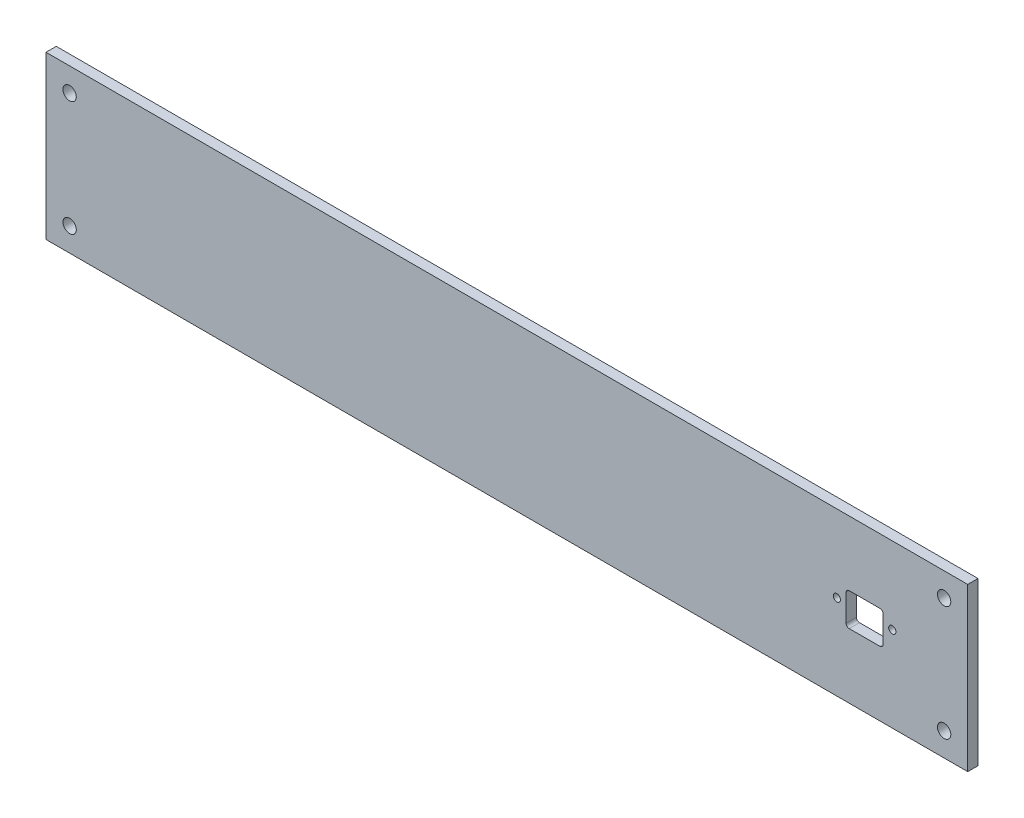
ISO-10303-21;
HEADER;
FILE_DESCRIPTION(('STEP AP214'),'2;1');
FILE_NAME('part.step','',(''),(''),'','','');
FILE_SCHEMA(('AUTOMOTIVE_DESIGN { 1 0 10303 214 1 1 1 1 }'));
ENDSEC;
DATA;
#1=APPLICATION_CONTEXT('core data for automotive mechanical design processes');
#2=APPLICATION_PROTOCOL_DEFINITION('international standard','automotive_design',2000,#1);
#3=PRODUCT_CONTEXT('',#1,'mechanical');
#4=PRODUCT('Part','Part','',(#3));
#5=PRODUCT_RELATED_PRODUCT_CATEGORY('part','',(#4));
#6=PRODUCT_DEFINITION_FORMATION('','',#4);
#7=PRODUCT_DEFINITION_CONTEXT('part definition',#1,'design');
#8=PRODUCT_DEFINITION('design','',#6,#7);
#9=PRODUCT_DEFINITION_SHAPE('','',#8);
#10=(LENGTH_UNIT() NAMED_UNIT(*) SI_UNIT(.MILLI.,.METRE.));
#11=(NAMED_UNIT(*) PLANE_ANGLE_UNIT() SI_UNIT($,.RADIAN.));
#12=(NAMED_UNIT(*) SI_UNIT($,.STERADIAN.) SOLID_ANGLE_UNIT());
#13=UNCERTAINTY_MEASURE_WITH_UNIT(LENGTH_MEASURE(1.E-05),#10,'distance_accuracy_value','');
#14=(GEOMETRIC_REPRESENTATION_CONTEXT(3) GLOBAL_UNCERTAINTY_ASSIGNED_CONTEXT((#13)) GLOBAL_UNIT_ASSIGNED_CONTEXT((#10,
#11,#12)) REPRESENTATION_CONTEXT('',''));
#15=CARTESIAN_POINT('',(0.,0.,0.));
#16=DIRECTION('',(0.,0.,1.));
#17=DIRECTION('',(1.,0.,0.));
#18=AXIS2_PLACEMENT_3D('',#15,#16,#17);
#19=CARTESIAN_POINT('',(0.,0.,5.));
#20=DIRECTION('',(0.,0.,-1.));
#21=DIRECTION('',(-1.,0.,0.));
#22=AXIS2_PLACEMENT_3D('',#19,#20,#21);
#23=PLANE('',#22);
#24=CARTESIAN_POINT('',(412.246939645977,41.5,5.));
#25=DIRECTION('',(0.,0.,1.));
#26=DIRECTION('',(-1.,0.,0.));
#27=AXIS2_PLACEMENT_3D('',#24,#25,#26);
#28=CIRCLE('',#27,1.74999999999998);
#29=CARTESIAN_POINT('',(410.496939645977,41.5,5.));
#30=VERTEX_POINT('',#29);
#31=EDGE_CURVE('E229',#30,#30,#28,.T.);
#32=ORIENTED_EDGE('',*,*,#31,.F.);
#33=EDGE_LOOP('',(#32));
#34=FACE_BOUND('',#33,.T.);
#35=CARTESIAN_POINT('',(385.246939645977,41.5,5.));
#36=DIRECTION('',(0.,0.,1.));
#37=DIRECTION('',(1.,0.,0.));
#38=AXIS2_PLACEMENT_3D('',#35,#36,#37);
#39=CIRCLE('',#38,1.74999999999998);
#40=CARTESIAN_POINT('',(386.996939645977,41.5,5.));
#41=VERTEX_POINT('',#40);
#42=EDGE_CURVE('E236',#41,#41,#39,.T.);
#43=ORIENTED_EDGE('',*,*,#42,.F.);
#44=EDGE_LOOP('',(#43));
#45=FACE_BOUND('',#44,.T.);
#46=CARTESIAN_POINT('',(437.5,11.5,5.));
#47=DIRECTION('',(0.,0.,1.));
#48=DIRECTION('',(1.,0.,0.));
#49=AXIS2_PLACEMENT_3D('',#46,#47,#48);
#50=CIRCLE('',#49,3.24999999999995);
#51=CARTESIAN_POINT('',(440.75,11.5,5.));
#52=VERTEX_POINT('',#51);
#53=EDGE_CURVE('E255',#52,#52,#50,.T.);
#54=ORIENTED_EDGE('',*,*,#53,.F.);
#55=EDGE_LOOP('',(#54));
#56=FACE_BOUND('',#55,.T.);
#57=CARTESIAN_POINT('',(11.5,11.5,5.));
#58=DIRECTION('',(0.,0.,1.));
#59=DIRECTION('',(-1.,0.,0.));
#60=AXIS2_PLACEMENT_3D('',#57,#58,#59);
#61=CIRCLE('',#60,3.25);
#62=CARTESIAN_POINT('',(8.25,11.5,5.));
#63=VERTEX_POINT('',#62);
#64=EDGE_CURVE('E254',#63,#63,#61,.T.);
#65=ORIENTED_EDGE('',*,*,#64,.F.);
#66=EDGE_LOOP('',(#65));
#67=FACE_BOUND('',#66,.T.);
#68=CARTESIAN_POINT('',(437.5,67.5,5.));
#69=DIRECTION('',(0.,0.,1.));
#70=DIRECTION('',(-1.,0.,0.));
#71=AXIS2_PLACEMENT_3D('',#68,#69,#70);
#72=CIRCLE('',#71,3.24999999999995);
#73=CARTESIAN_POINT('',(434.25,67.5,5.));
#74=VERTEX_POINT('',#73);
#75=EDGE_CURVE('E257',#74,#74,#72,.T.);
#76=ORIENTED_EDGE('',*,*,#75,.F.);
#77=EDGE_LOOP('',(#76));
#78=FACE_BOUND('',#77,.T.);
#79=CARTESIAN_POINT('',(11.5,67.5,5.));
#80=DIRECTION('',(0.,0.,1.));
#81=DIRECTION('',(1.,0.,0.));
#82=AXIS2_PLACEMENT_3D('',#79,#80,#81);
#83=CIRCLE('',#82,3.25);
#84=CARTESIAN_POINT('',(14.75,67.5,5.));
#85=VERTEX_POINT('',#84);
#86=EDGE_CURVE('E266',#85,#85,#83,.T.);
#87=ORIENTED_EDGE('',*,*,#86,.F.);
#88=EDGE_LOOP('',(#87));
#89=FACE_BOUND('',#88,.T.);
#90=DIRECTION('',(1.,0.,0.));
#91=VECTOR('',#90,1.);
#92=CARTESIAN_POINT('',(449.,0.,5.));
#93=LINE('',#92,#91);
#94=CARTESIAN_POINT('',(0.,0.,5.));
#95=VERTEX_POINT('',#94);
#96=CARTESIAN_POINT('',(449.,0.,5.));
#97=VERTEX_POINT('',#96);
#98=EDGE_CURVE('E292',#95,#97,#93,.T.);
#99=ORIENTED_EDGE('',*,*,#98,.T.);
#100=DIRECTION('',(0.,1.,0.));
#101=VECTOR('',#100,1.);
#102=CARTESIAN_POINT('',(449.,79.,5.));
#103=LINE('',#102,#101);
#104=CARTESIAN_POINT('',(449.,79.,5.));
#105=VERTEX_POINT('',#104);
#106=EDGE_CURVE('E294',#97,#105,#103,.T.);
#107=ORIENTED_EDGE('',*,*,#106,.T.);
#108=DIRECTION('',(-1.,0.,0.));
#109=VECTOR('',#108,1.);
#110=CARTESIAN_POINT('',(0.,79.,5.));
#111=LINE('',#110,#109);
#112=CARTESIAN_POINT('',(0.,79.,5.));
#113=VERTEX_POINT('',#112);
#114=EDGE_CURVE('E311',#105,#113,#111,.T.);
#115=ORIENTED_EDGE('',*,*,#114,.T.);
#116=DIRECTION('',(0.,-1.,0.));
#117=VECTOR('',#116,1.);
#118=CARTESIAN_POINT('',(0.,0.,5.));
#119=LINE('',#118,#117);
#120=EDGE_CURVE('E297',#113,#95,#119,.T.);
#121=ORIENTED_EDGE('',*,*,#120,.T.);
#122=EDGE_LOOP('',(#99,#107,#115,#121));
#123=FACE_BOUND('',#122,.T.);
#124=CARTESIAN_POINT('',(406.246939645977,46.,5.));
#125=DIRECTION('',(0.,0.,1.));
#126=DIRECTION('',(1.,0.,0.));
#127=AXIS2_PLACEMENT_3D('',#124,#125,#126);
#128=CIRCLE('',#127,1.5);
#129=CARTESIAN_POINT('',(407.746939645977,46.,5.));
#130=VERTEX_POINT('',#129);
#131=CARTESIAN_POINT('',(406.246939645977,47.5,5.));
#132=VERTEX_POINT('',#131);
#133=EDGE_CURVE('E141',#130,#132,#128,.T.);
#134=ORIENTED_EDGE('',*,*,#133,.F.);
#135=DIRECTION('',(0.,1.,0.));
#136=VECTOR('',#135,1.);
#137=CARTESIAN_POINT('',(407.746939645977,33.,5.));
#138=LINE('',#137,#136);
#139=CARTESIAN_POINT('',(407.746939645977,33.,5.));
#140=VERTEX_POINT('',#139);
#141=EDGE_CURVE('E196',#140,#130,#138,.T.);
#142=ORIENTED_EDGE('',*,*,#141,.F.);
#143=CARTESIAN_POINT('',(406.246939645977,33.,5.));
#144=DIRECTION('',(0.,0.,1.));
#145=DIRECTION('',(-1.,0.,0.));
#146=AXIS2_PLACEMENT_3D('',#143,#144,#145);
#147=CIRCLE('',#146,1.5);
#148=CARTESIAN_POINT('',(406.246939645977,31.5,5.));
#149=VERTEX_POINT('',#148);
#150=EDGE_CURVE('E192',#149,#140,#147,.T.);
#151=ORIENTED_EDGE('',*,*,#150,.F.);
#152=DIRECTION('',(1.,0.,0.));
#153=VECTOR('',#152,1.);
#154=CARTESIAN_POINT('',(406.246939645977,31.5,5.));
#155=LINE('',#154,#153);
#156=CARTESIAN_POINT('',(391.246939645977,31.5,5.));
#157=VERTEX_POINT('',#156);
#158=EDGE_CURVE('E187',#157,#149,#155,.T.);
#159=ORIENTED_EDGE('',*,*,#158,.F.);
#160=CARTESIAN_POINT('',(391.246939645977,33.,5.));
#161=DIRECTION('',(0.,0.,1.));
#162=DIRECTION('',(-1.,0.,0.));
#163=AXIS2_PLACEMENT_3D('',#160,#161,#162);
#164=CIRCLE('',#163,1.5);
#165=CARTESIAN_POINT('',(389.746939645977,33.,5.));
#166=VERTEX_POINT('',#165);
#167=EDGE_CURVE('E184',#166,#157,#164,.T.);
#168=ORIENTED_EDGE('',*,*,#167,.F.);
#169=DIRECTION('',(0.,-1.,0.));
#170=VECTOR('',#169,1.);
#171=CARTESIAN_POINT('',(389.746939645977,46.,5.));
#172=LINE('',#171,#170);
#173=CARTESIAN_POINT('',(389.746939645977,46.,5.));
#174=VERTEX_POINT('',#173);
#175=EDGE_CURVE('E168',#174,#166,#172,.T.);
#176=ORIENTED_EDGE('',*,*,#175,.F.);
#177=CARTESIAN_POINT('',(391.246939645977,46.,5.));
#178=DIRECTION('',(0.,0.,1.));
#179=DIRECTION('',(-1.,0.,0.));
#180=AXIS2_PLACEMENT_3D('',#177,#178,#179);
#181=CIRCLE('',#180,1.5);
#182=CARTESIAN_POINT('',(391.246939645977,47.5,5.));
#183=VERTEX_POINT('',#182);
#184=EDGE_CURVE('E162',#183,#174,#181,.T.);
#185=ORIENTED_EDGE('',*,*,#184,.F.);
#186=DIRECTION('',(-1.,0.,0.));
#187=VECTOR('',#186,1.);
#188=CARTESIAN_POINT('',(406.246939645977,47.5,5.));
#189=LINE('',#188,#187);
#190=EDGE_CURVE('E150',#132,#183,#189,.T.);
#191=ORIENTED_EDGE('',*,*,#190,.F.);
#192=EDGE_LOOP('',(#134,#142,#151,#159,#168,#176,#185,#191));
#193=FACE_BOUND('',#192,.T.);
#194=ADVANCED_FACE('F42',(#34,#45,#56,#67,#78,#89,#123,#193),#23,.F.);
#195=CARTESIAN_POINT('',(0.,0.,0.));
#196=DIRECTION('',(0.,0.,-1.));
#197=DIRECTION('',(-1.,0.,0.));
#198=AXIS2_PLACEMENT_3D('',#195,#196,#197);
#199=PLANE('',#198);
#200=CARTESIAN_POINT('',(385.246939645977,41.5,0.));
#201=DIRECTION('',(0.,0.,1.));
#202=DIRECTION('',(1.,0.,0.));
#203=AXIS2_PLACEMENT_3D('',#200,#201,#202);
#204=CIRCLE('',#203,1.74999999999998);
#205=CARTESIAN_POINT('',(386.996939645977,41.5,0.));
#206=VERTEX_POINT('',#205);
#207=EDGE_CURVE('E233',#206,#206,#204,.T.);
#208=ORIENTED_EDGE('',*,*,#207,.T.);
#209=EDGE_LOOP('',(#208));
#210=FACE_BOUND('',#209,.T.);
#211=CARTESIAN_POINT('',(11.5,11.5,0.));
#212=DIRECTION('',(0.,0.,1.));
#213=DIRECTION('',(-1.,0.,0.));
#214=AXIS2_PLACEMENT_3D('',#211,#212,#213);
#215=CIRCLE('',#214,3.25);
#216=CARTESIAN_POINT('',(8.25,11.5,0.));
#217=VERTEX_POINT('',#216);
#218=EDGE_CURVE('E248',#217,#217,#215,.T.);
#219=ORIENTED_EDGE('',*,*,#218,.T.);
#220=EDGE_LOOP('',(#219));
#221=FACE_BOUND('',#220,.T.);
#222=CARTESIAN_POINT('',(11.5,67.5,0.));
#223=DIRECTION('',(0.,0.,1.));
#224=DIRECTION('',(1.,0.,0.));
#225=AXIS2_PLACEMENT_3D('',#222,#223,#224);
#226=CIRCLE('',#225,3.25);
#227=CARTESIAN_POINT('',(14.75,67.5,0.));
#228=VERTEX_POINT('',#227);
#229=EDGE_CURVE('E260',#228,#228,#226,.T.);
#230=ORIENTED_EDGE('',*,*,#229,.T.);
#231=EDGE_LOOP('',(#230));
#232=FACE_BOUND('',#231,.T.);
#233=DIRECTION('',(1.,0.,0.));
#234=VECTOR('',#233,1.);
#235=CARTESIAN_POINT('',(449.,0.,0.));
#236=LINE('',#235,#234);
#237=CARTESIAN_POINT('',(0.,0.,0.));
#238=VERTEX_POINT('',#237);
#239=CARTESIAN_POINT('',(449.,0.,0.));
#240=VERTEX_POINT('',#239);
#241=EDGE_CURVE('E305',#238,#240,#236,.T.);
#242=ORIENTED_EDGE('',*,*,#241,.F.);
#243=DIRECTION('',(0.,-1.,0.));
#244=VECTOR('',#243,1.);
#245=CARTESIAN_POINT('',(0.,0.,0.));
#246=LINE('',#245,#244);
#247=CARTESIAN_POINT('',(0.,79.,0.));
#248=VERTEX_POINT('',#247);
#249=EDGE_CURVE('E301',#248,#238,#246,.T.);
#250=ORIENTED_EDGE('',*,*,#249,.F.);
#251=DIRECTION('',(-1.,0.,0.));
#252=VECTOR('',#251,1.);
#253=CARTESIAN_POINT('',(0.,79.,0.));
#254=LINE('',#253,#252);
#255=CARTESIAN_POINT('',(449.,79.,0.));
#256=VERTEX_POINT('',#255);
#257=EDGE_CURVE('E319',#256,#248,#254,.T.);
#258=ORIENTED_EDGE('',*,*,#257,.F.);
#259=DIRECTION('',(0.,1.,0.));
#260=VECTOR('',#259,1.);
#261=CARTESIAN_POINT('',(449.,79.,0.));
#262=LINE('',#261,#260);
#263=EDGE_CURVE('E308',#240,#256,#262,.T.);
#264=ORIENTED_EDGE('',*,*,#263,.F.);
#265=EDGE_LOOP('',(#242,#250,#258,#264));
#266=FACE_BOUND('',#265,.T.);
#267=CARTESIAN_POINT('',(437.5,67.5,0.));
#268=DIRECTION('',(0.,0.,1.));
#269=DIRECTION('',(-1.,0.,0.));
#270=AXIS2_PLACEMENT_3D('',#267,#268,#269);
#271=CIRCLE('',#270,3.24999999999995);
#272=CARTESIAN_POINT('',(434.25,67.5,0.));
#273=VERTEX_POINT('',#272);
#274=EDGE_CURVE('E261',#273,#273,#271,.T.);
#275=ORIENTED_EDGE('',*,*,#274,.T.);
#276=EDGE_LOOP('',(#275));
#277=FACE_BOUND('',#276,.T.);
#278=CARTESIAN_POINT('',(437.5,11.5,0.));
#279=DIRECTION('',(0.,0.,1.));
#280=DIRECTION('',(1.,0.,0.));
#281=AXIS2_PLACEMENT_3D('',#278,#279,#280);
#282=CIRCLE('',#281,3.24999999999995);
#283=CARTESIAN_POINT('',(440.75,11.5,0.));
#284=VERTEX_POINT('',#283);
#285=EDGE_CURVE('E241',#284,#284,#282,.T.);
#286=ORIENTED_EDGE('',*,*,#285,.T.);
#287=EDGE_LOOP('',(#286));
#288=FACE_BOUND('',#287,.T.);
#289=CARTESIAN_POINT('',(412.246939645977,41.5,0.));
#290=DIRECTION('',(0.,0.,1.));
#291=DIRECTION('',(-1.,0.,0.));
#292=AXIS2_PLACEMENT_3D('',#289,#290,#291);
#293=CIRCLE('',#292,1.74999999999998);
#294=CARTESIAN_POINT('',(410.496939645977,41.5,0.));
#295=VERTEX_POINT('',#294);
#296=EDGE_CURVE('E157',#295,#295,#293,.T.);
#297=ORIENTED_EDGE('',*,*,#296,.T.);
#298=EDGE_LOOP('',(#297));
#299=FACE_BOUND('',#298,.T.);
#300=DIRECTION('',(0.,1.,0.));
#301=VECTOR('',#300,1.);
#302=CARTESIAN_POINT('',(407.746939645977,33.,0.));
#303=LINE('',#302,#301);
#304=CARTESIAN_POINT('',(407.746939645977,33.,0.));
#305=VERTEX_POINT('',#304);
#306=CARTESIAN_POINT('',(407.746939645977,46.,0.));
#307=VERTEX_POINT('',#306);
#308=EDGE_CURVE('E151',#305,#307,#303,.T.);
#309=ORIENTED_EDGE('',*,*,#308,.T.);
#310=CARTESIAN_POINT('',(406.246939645977,46.,0.));
#311=DIRECTION('',(0.,0.,1.));
#312=DIRECTION('',(1.,0.,0.));
#313=AXIS2_PLACEMENT_3D('',#310,#311,#312);
#314=CIRCLE('',#313,1.5);
#315=CARTESIAN_POINT('',(406.246939645977,47.5,0.));
#316=VERTEX_POINT('',#315);
#317=EDGE_CURVE('E68',#307,#316,#314,.T.);
#318=ORIENTED_EDGE('',*,*,#317,.T.);
#319=DIRECTION('',(-1.,0.,0.));
#320=VECTOR('',#319,1.);
#321=CARTESIAN_POINT('',(406.246939645977,47.5,0.));
#322=LINE('',#321,#320);
#323=CARTESIAN_POINT('',(391.246939645977,47.5,0.));
#324=VERTEX_POINT('',#323);
#325=EDGE_CURVE('E156',#316,#324,#322,.T.);
#326=ORIENTED_EDGE('',*,*,#325,.T.);
#327=CARTESIAN_POINT('',(391.246939645977,46.,0.));
#328=DIRECTION('',(0.,0.,1.));
#329=DIRECTION('',(-1.,0.,0.));
#330=AXIS2_PLACEMENT_3D('',#327,#328,#329);
#331=CIRCLE('',#330,1.5);
#332=CARTESIAN_POINT('',(389.746939645977,46.,0.));
#333=VERTEX_POINT('',#332);
#334=EDGE_CURVE('E202',#324,#333,#331,.T.);
#335=ORIENTED_EDGE('',*,*,#334,.T.);
#336=DIRECTION('',(0.,-1.,0.));
#337=VECTOR('',#336,1.);
#338=CARTESIAN_POINT('',(389.746939645977,46.,0.));
#339=LINE('',#338,#337);
#340=CARTESIAN_POINT('',(389.746939645977,33.,0.));
#341=VERTEX_POINT('',#340);
#342=EDGE_CURVE('E205',#333,#341,#339,.T.);
#343=ORIENTED_EDGE('',*,*,#342,.T.);
#344=CARTESIAN_POINT('',(391.246939645977,33.,0.));
#345=DIRECTION('',(0.,0.,1.));
#346=DIRECTION('',(-1.,0.,0.));
#347=AXIS2_PLACEMENT_3D('',#344,#345,#346);
#348=CIRCLE('',#347,1.5);
#349=CARTESIAN_POINT('',(391.246939645977,31.5,0.));
#350=VERTEX_POINT('',#349);
#351=EDGE_CURVE('E208',#341,#350,#348,.T.);
#352=ORIENTED_EDGE('',*,*,#351,.T.);
#353=DIRECTION('',(1.,0.,0.));
#354=VECTOR('',#353,1.);
#355=CARTESIAN_POINT('',(406.246939645977,31.5,0.));
#356=LINE('',#355,#354);
#357=CARTESIAN_POINT('',(406.246939645977,31.5,0.));
#358=VERTEX_POINT('',#357);
#359=EDGE_CURVE('E211',#350,#358,#356,.T.);
#360=ORIENTED_EDGE('',*,*,#359,.T.);
#361=CARTESIAN_POINT('',(406.246939645977,33.,0.));
#362=DIRECTION('',(0.,0.,1.));
#363=DIRECTION('',(-1.,0.,0.));
#364=AXIS2_PLACEMENT_3D('',#361,#362,#363);
#365=CIRCLE('',#364,1.5);
#366=EDGE_CURVE('E214',#358,#305,#365,.T.);
#367=ORIENTED_EDGE('',*,*,#366,.T.);
#368=EDGE_LOOP('',(#309,#318,#326,#335,#343,#352,#360,#367));
#369=FACE_BOUND('',#368,.T.);
#370=ADVANCED_FACE('F279',(#210,#221,#232,#266,#277,#288,#299,#369),#199,.T.);
#371=CARTESIAN_POINT('',(449.,0.,5.));
#372=DIRECTION('',(0.,1.,0.));
#373=DIRECTION('',(-1.,0.,0.));
#374=AXIS2_PLACEMENT_3D('',#371,#372,#373);
#375=PLANE('',#374);
#376=ORIENTED_EDGE('',*,*,#241,.T.);
#377=DIRECTION('',(0.,0.,-1.));
#378=VECTOR('',#377,1.);
#379=CARTESIAN_POINT('',(449.,0.,5.));
#380=LINE('',#379,#378);
#381=EDGE_CURVE('E12',#97,#240,#380,.T.);
#382=ORIENTED_EDGE('',*,*,#381,.F.);
#383=ORIENTED_EDGE('',*,*,#98,.F.);
#384=DIRECTION('',(0.,0.,-1.));
#385=VECTOR('',#384,1.);
#386=CARTESIAN_POINT('',(0.,0.,5.));
#387=LINE('',#386,#385);
#388=EDGE_CURVE('E316',#95,#238,#387,.T.);
#389=ORIENTED_EDGE('',*,*,#388,.T.);
#390=EDGE_LOOP('',(#376,#382,#383,#389));
#391=FACE_BOUND('',#390,.T.);
#392=ADVANCED_FACE('F44',(#391),#375,.F.);
#393=CARTESIAN_POINT('',(449.,79.,5.));
#394=DIRECTION('',(-1.,0.,0.));
#395=DIRECTION('',(0.,0.,1.));
#396=AXIS2_PLACEMENT_3D('',#393,#394,#395);
#397=PLANE('',#396);
#398=ORIENTED_EDGE('',*,*,#263,.T.);
#399=DIRECTION('',(0.,0.,-1.));
#400=VECTOR('',#399,1.);
#401=CARTESIAN_POINT('',(449.,79.,5.));
#402=LINE('',#401,#400);
#403=EDGE_CURVE('E50',#105,#256,#402,.T.);
#404=ORIENTED_EDGE('',*,*,#403,.F.);
#405=ORIENTED_EDGE('',*,*,#106,.F.);
#406=ORIENTED_EDGE('',*,*,#381,.T.);
#407=EDGE_LOOP('',(#398,#404,#405,#406));
#408=FACE_BOUND('',#407,.T.);
#409=ADVANCED_FACE('F307',(#408),#397,.F.);
#410=CARTESIAN_POINT('',(0.,79.,5.));
#411=DIRECTION('',(0.,-1.,0.));
#412=DIRECTION('',(0.,0.,-1.));
#413=AXIS2_PLACEMENT_3D('',#410,#411,#412);
#414=PLANE('',#413);
#415=ORIENTED_EDGE('',*,*,#257,.T.);
#416=DIRECTION('',(0.,0.,-1.));
#417=VECTOR('',#416,1.);
#418=CARTESIAN_POINT('',(0.,79.,5.));
#419=LINE('',#418,#417);
#420=EDGE_CURVE('E323',#113,#248,#419,.T.);
#421=ORIENTED_EDGE('',*,*,#420,.F.);
#422=ORIENTED_EDGE('',*,*,#114,.F.);
#423=ORIENTED_EDGE('',*,*,#403,.T.);
#424=EDGE_LOOP('',(#415,#421,#422,#423));
#425=FACE_BOUND('',#424,.T.);
#426=ADVANCED_FACE('F327',(#425),#414,.F.);
#427=CARTESIAN_POINT('',(0.,0.,5.));
#428=DIRECTION('',(1.,0.,0.));
#429=DIRECTION('',(0.,1.,0.));
#430=AXIS2_PLACEMENT_3D('',#427,#428,#429);
#431=PLANE('',#430);
#432=ORIENTED_EDGE('',*,*,#249,.T.);
#433=ORIENTED_EDGE('',*,*,#388,.F.);
#434=ORIENTED_EDGE('',*,*,#120,.F.);
#435=ORIENTED_EDGE('',*,*,#420,.T.);
#436=EDGE_LOOP('',(#432,#433,#434,#435));
#437=FACE_BOUND('',#436,.T.);
#438=ADVANCED_FACE('F333',(#437),#431,.F.);
#439=CARTESIAN_POINT('',(11.5,67.5,5.));
#440=DIRECTION('',(0.,0.,-1.));
#441=DIRECTION('',(-1.,0.,0.));
#442=AXIS2_PLACEMENT_3D('',#439,#440,#441);
#443=CYLINDRICAL_SURFACE('',#442,3.25);
#444=ORIENTED_EDGE('',*,*,#86,.T.);
#445=EDGE_LOOP('',(#444));
#446=FACE_BOUND('',#445,.T.);
#447=ORIENTED_EDGE('',*,*,#229,.F.);
#448=EDGE_LOOP('',(#447));
#449=FACE_BOUND('',#448,.T.);
#450=ADVANCED_FACE('F335',(#446,#449),#443,.F.);
#451=CARTESIAN_POINT('',(437.5,67.5,5.));
#452=DIRECTION('',(0.,0.,-1.));
#453=DIRECTION('',(-1.,0.,0.));
#454=AXIS2_PLACEMENT_3D('',#451,#452,#453);
#455=CYLINDRICAL_SURFACE('',#454,3.24999999999995);
#456=ORIENTED_EDGE('',*,*,#75,.T.);
#457=EDGE_LOOP('',(#456));
#458=FACE_BOUND('',#457,.T.);
#459=ORIENTED_EDGE('',*,*,#274,.F.);
#460=EDGE_LOOP('',(#459));
#461=FACE_BOUND('',#460,.T.);
#462=ADVANCED_FACE('F341',(#458,#461),#455,.F.);
#463=CARTESIAN_POINT('',(11.5,11.5,5.));
#464=DIRECTION('',(0.,0.,-1.));
#465=DIRECTION('',(-1.,0.,0.));
#466=AXIS2_PLACEMENT_3D('',#463,#464,#465);
#467=CYLINDRICAL_SURFACE('',#466,3.25);
#468=ORIENTED_EDGE('',*,*,#64,.T.);
#469=EDGE_LOOP('',(#468));
#470=FACE_BOUND('',#469,.T.);
#471=ORIENTED_EDGE('',*,*,#218,.F.);
#472=EDGE_LOOP('',(#471));
#473=FACE_BOUND('',#472,.T.);
#474=ADVANCED_FACE('F367',(#470,#473),#467,.F.);
#475=CARTESIAN_POINT('',(437.5,11.5,5.));
#476=DIRECTION('',(0.,0.,-1.));
#477=DIRECTION('',(-1.,0.,0.));
#478=AXIS2_PLACEMENT_3D('',#475,#476,#477);
#479=CYLINDRICAL_SURFACE('',#478,3.24999999999995);
#480=ORIENTED_EDGE('',*,*,#53,.T.);
#481=EDGE_LOOP('',(#480));
#482=FACE_BOUND('',#481,.T.);
#483=ORIENTED_EDGE('',*,*,#285,.F.);
#484=EDGE_LOOP('',(#483));
#485=FACE_BOUND('',#484,.T.);
#486=ADVANCED_FACE('F274',(#482,#485),#479,.F.);
#487=CARTESIAN_POINT('',(385.246939645977,41.5,5.));
#488=DIRECTION('',(0.,0.,-1.));
#489=DIRECTION('',(-1.,0.,0.));
#490=AXIS2_PLACEMENT_3D('',#487,#488,#489);
#491=CYLINDRICAL_SURFACE('',#490,1.74999999999998);
#492=ORIENTED_EDGE('',*,*,#42,.T.);
#493=EDGE_LOOP('',(#492));
#494=FACE_BOUND('',#493,.T.);
#495=ORIENTED_EDGE('',*,*,#207,.F.);
#496=EDGE_LOOP('',(#495));
#497=FACE_BOUND('',#496,.T.);
#498=ADVANCED_FACE('F375',(#494,#497),#491,.F.);
#499=CARTESIAN_POINT('',(412.246939645977,41.5,5.));
#500=DIRECTION('',(0.,0.,-1.));
#501=DIRECTION('',(-1.,0.,0.));
#502=AXIS2_PLACEMENT_3D('',#499,#500,#501);
#503=CYLINDRICAL_SURFACE('',#502,1.74999999999998);
#504=ORIENTED_EDGE('',*,*,#31,.T.);
#505=EDGE_LOOP('',(#504));
#506=FACE_BOUND('',#505,.T.);
#507=ORIENTED_EDGE('',*,*,#296,.F.);
#508=EDGE_LOOP('',(#507));
#509=FACE_BOUND('',#508,.T.);
#510=ADVANCED_FACE('F382',(#506,#509),#503,.F.);
#511=CARTESIAN_POINT('',(406.246939645977,46.,5.));
#512=DIRECTION('',(0.,0.,-1.));
#513=DIRECTION('',(-1.,0.,0.));
#514=AXIS2_PLACEMENT_3D('',#511,#512,#513);
#515=CYLINDRICAL_SURFACE('',#514,1.5);
#516=ORIENTED_EDGE('',*,*,#317,.F.);
#517=DIRECTION('',(0.,0.,-1.));
#518=VECTOR('',#517,1.);
#519=CARTESIAN_POINT('',(407.746939645977,46.,5.));
#520=LINE('',#519,#518);
#521=EDGE_CURVE('E145',#130,#307,#520,.T.);
#522=ORIENTED_EDGE('',*,*,#521,.F.);
#523=ORIENTED_EDGE('',*,*,#133,.T.);
#524=DIRECTION('',(0.,0.,-1.));
#525=VECTOR('',#524,1.);
#526=CARTESIAN_POINT('',(406.246939645977,47.5,5.));
#527=LINE('',#526,#525);
#528=EDGE_CURVE('E144',#132,#316,#527,.T.);
#529=ORIENTED_EDGE('',*,*,#528,.T.);
#530=EDGE_LOOP('',(#516,#522,#523,#529));
#531=FACE_BOUND('',#530,.T.);
#532=ADVANCED_FACE('F143',(#531),#515,.F.);
#533=CARTESIAN_POINT('',(406.246939645977,47.5,5.));
#534=DIRECTION('',(0.,-1.,0.));
#535=DIRECTION('',(0.,0.,-1.));
#536=AXIS2_PLACEMENT_3D('',#533,#534,#535);
#537=PLANE('',#536);
#538=ORIENTED_EDGE('',*,*,#325,.F.);
#539=ORIENTED_EDGE('',*,*,#528,.F.);
#540=ORIENTED_EDGE('',*,*,#190,.T.);
#541=DIRECTION('',(0.,0.,-1.));
#542=VECTOR('',#541,1.);
#543=CARTESIAN_POINT('',(391.246939645977,47.5,5.));
#544=LINE('',#543,#542);
#545=EDGE_CURVE('E158',#183,#324,#544,.T.);
#546=ORIENTED_EDGE('',*,*,#545,.T.);
#547=EDGE_LOOP('',(#538,#539,#540,#546));
#548=FACE_BOUND('',#547,.T.);
#549=ADVANCED_FACE('F153',(#548),#537,.T.);
#550=CARTESIAN_POINT('',(391.246939645977,46.,5.));
#551=DIRECTION('',(0.,0.,-1.));
#552=DIRECTION('',(-1.,0.,0.));
#553=AXIS2_PLACEMENT_3D('',#550,#551,#552);
#554=CYLINDRICAL_SURFACE('',#553,1.5);
#555=ORIENTED_EDGE('',*,*,#334,.F.);
#556=ORIENTED_EDGE('',*,*,#545,.F.);
#557=ORIENTED_EDGE('',*,*,#184,.T.);
#558=DIRECTION('',(0.,0.,-1.));
#559=VECTOR('',#558,1.);
#560=CARTESIAN_POINT('',(389.746939645977,46.,5.));
#561=LINE('',#560,#559);
#562=EDGE_CURVE('E227',#174,#333,#561,.T.);
#563=ORIENTED_EDGE('',*,*,#562,.T.);
#564=EDGE_LOOP('',(#555,#556,#557,#563));
#565=FACE_BOUND('',#564,.T.);
#566=ADVANCED_FACE('F391',(#565),#554,.F.);
#567=CARTESIAN_POINT('',(389.746939645977,46.,5.));
#568=DIRECTION('',(1.,0.,0.));
#569=DIRECTION('',(0.,0.,-1.));
#570=AXIS2_PLACEMENT_3D('',#567,#568,#569);
#571=PLANE('',#570);
#572=ORIENTED_EDGE('',*,*,#342,.F.);
#573=ORIENTED_EDGE('',*,*,#562,.F.);
#574=ORIENTED_EDGE('',*,*,#175,.T.);
#575=DIRECTION('',(0.,0.,-1.));
#576=VECTOR('',#575,1.);
#577=CARTESIAN_POINT('',(389.746939645977,33.,5.));
#578=LINE('',#577,#576);
#579=EDGE_CURVE('E225',#166,#341,#578,.T.);
#580=ORIENTED_EDGE('',*,*,#579,.T.);
#581=EDGE_LOOP('',(#572,#573,#574,#580));
#582=FACE_BOUND('',#581,.T.);
#583=ADVANCED_FACE('F394',(#582),#571,.T.);
#584=CARTESIAN_POINT('',(391.246939645977,33.,5.));
#585=DIRECTION('',(0.,0.,-1.));
#586=DIRECTION('',(-1.,0.,0.));
#587=AXIS2_PLACEMENT_3D('',#584,#585,#586);
#588=CYLINDRICAL_SURFACE('',#587,1.5);
#589=ORIENTED_EDGE('',*,*,#351,.F.);
#590=ORIENTED_EDGE('',*,*,#579,.F.);
#591=ORIENTED_EDGE('',*,*,#167,.T.);
#592=DIRECTION('',(0.,0.,-1.));
#593=VECTOR('',#592,1.);
#594=CARTESIAN_POINT('',(391.246939645977,31.5,5.));
#595=LINE('',#594,#593);
#596=EDGE_CURVE('E223',#157,#350,#595,.T.);
#597=ORIENTED_EDGE('',*,*,#596,.T.);
#598=EDGE_LOOP('',(#589,#590,#591,#597));
#599=FACE_BOUND('',#598,.T.);
#600=ADVANCED_FACE('F398',(#599),#588,.F.);
#601=CARTESIAN_POINT('',(406.246939645977,31.5,5.));
#602=DIRECTION('',(0.,1.,0.));
#603=DIRECTION('',(0.,0.,1.));
#604=AXIS2_PLACEMENT_3D('',#601,#602,#603);
#605=PLANE('',#604);
#606=ORIENTED_EDGE('',*,*,#359,.F.);
#607=ORIENTED_EDGE('',*,*,#596,.F.);
#608=ORIENTED_EDGE('',*,*,#158,.T.);
#609=DIRECTION('',(0.,0.,-1.));
#610=VECTOR('',#609,1.);
#611=CARTESIAN_POINT('',(406.246939645977,31.5,5.));
#612=LINE('',#611,#610);
#613=EDGE_CURVE('E221',#149,#358,#612,.T.);
#614=ORIENTED_EDGE('',*,*,#613,.T.);
#615=EDGE_LOOP('',(#606,#607,#608,#614));
#616=FACE_BOUND('',#615,.T.);
#617=ADVANCED_FACE('F402',(#616),#605,.T.);
#618=CARTESIAN_POINT('',(406.246939645977,33.,5.));
#619=DIRECTION('',(0.,0.,-1.));
#620=DIRECTION('',(-1.,0.,0.));
#621=AXIS2_PLACEMENT_3D('',#618,#619,#620);
#622=CYLINDRICAL_SURFACE('',#621,1.5);
#623=ORIENTED_EDGE('',*,*,#366,.F.);
#624=ORIENTED_EDGE('',*,*,#613,.F.);
#625=ORIENTED_EDGE('',*,*,#150,.T.);
#626=DIRECTION('',(0.,0.,-1.));
#627=VECTOR('',#626,1.);
#628=CARTESIAN_POINT('',(407.746939645977,33.,5.));
#629=LINE('',#628,#627);
#630=EDGE_CURVE('E60',#140,#305,#629,.T.);
#631=ORIENTED_EDGE('',*,*,#630,.T.);
#632=EDGE_LOOP('',(#623,#624,#625,#631));
#633=FACE_BOUND('',#632,.T.);
#634=ADVANCED_FACE('F406',(#633),#622,.F.);
#635=CARTESIAN_POINT('',(407.746939645977,33.,5.));
#636=DIRECTION('',(-1.,0.,0.));
#637=DIRECTION('',(0.,0.,1.));
#638=AXIS2_PLACEMENT_3D('',#635,#636,#637);
#639=PLANE('',#638);
#640=ORIENTED_EDGE('',*,*,#308,.F.);
#641=ORIENTED_EDGE('',*,*,#630,.F.);
#642=ORIENTED_EDGE('',*,*,#141,.T.);
#643=ORIENTED_EDGE('',*,*,#521,.T.);
#644=EDGE_LOOP('',(#640,#641,#642,#643));
#645=FACE_BOUND('',#644,.T.);
#646=ADVANCED_FACE('F410',(#645),#639,.T.);
#647=CLOSED_SHELL('',(#194,#370,#392,#409,#426,#438,#450,#462,#474,#486,#498,#510,#532,#549,
#566,#583,#600,#617,#634,#646));
#648=MANIFOLD_SOLID_BREP('B2',#647);
#649=ADVANCED_BREP_SHAPE_REPRESENTATION('',(#18,#648),#14);
#650=SHAPE_DEFINITION_REPRESENTATION(#9,#649);
ENDSEC;
END-ISO-10303-21;
